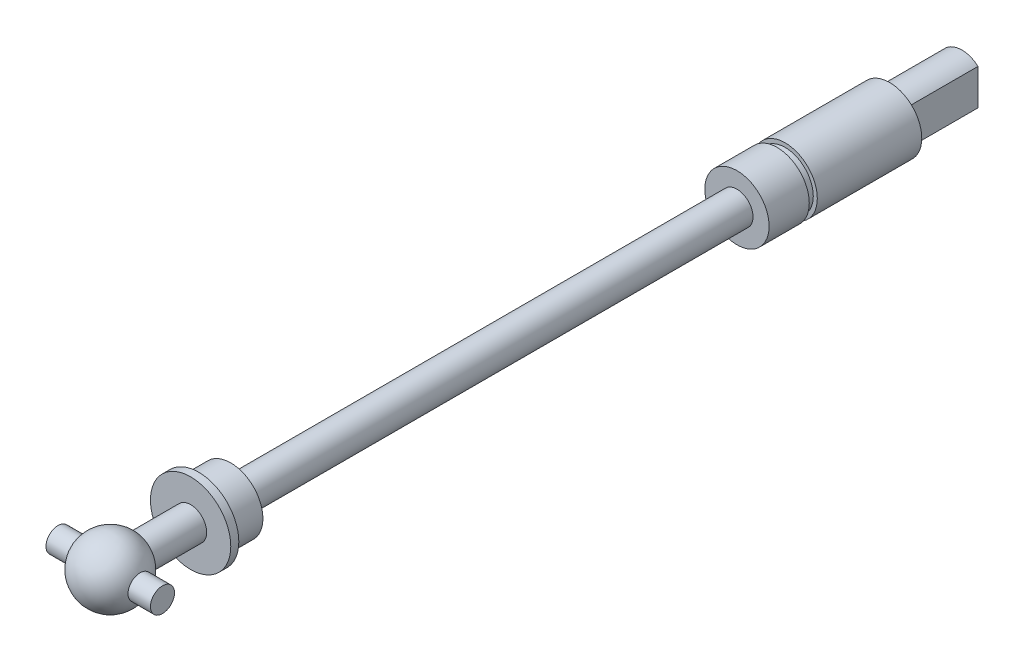
ISO-10303-21;
HEADER;
FILE_DESCRIPTION(('STEP AP214'),'2;1');
FILE_NAME('part.step','',(''),(''),'','','');
FILE_SCHEMA(('AUTOMOTIVE_DESIGN { 1 0 10303 214 1 1 1 1 }'));
ENDSEC;
DATA;
#1=APPLICATION_CONTEXT('core data for automotive mechanical design processes');
#2=APPLICATION_PROTOCOL_DEFINITION('international standard','automotive_design',2000,#1);
#3=PRODUCT_CONTEXT('',#1,'mechanical');
#4=PRODUCT('Part','Part','',(#3));
#5=PRODUCT_RELATED_PRODUCT_CATEGORY('part','',(#4));
#6=PRODUCT_DEFINITION_FORMATION('','',#4);
#7=PRODUCT_DEFINITION_CONTEXT('part definition',#1,'design');
#8=PRODUCT_DEFINITION('design','',#6,#7);
#9=PRODUCT_DEFINITION_SHAPE('','',#8);
#10=(LENGTH_UNIT() NAMED_UNIT(*) SI_UNIT(.MILLI.,.METRE.));
#11=(NAMED_UNIT(*) PLANE_ANGLE_UNIT() SI_UNIT($,.RADIAN.));
#12=(NAMED_UNIT(*) SI_UNIT($,.STERADIAN.) SOLID_ANGLE_UNIT());
#13=UNCERTAINTY_MEASURE_WITH_UNIT(LENGTH_MEASURE(1.E-05),#10,'distance_accuracy_value','');
#14=(GEOMETRIC_REPRESENTATION_CONTEXT(3) GLOBAL_UNCERTAINTY_ASSIGNED_CONTEXT((#13)) GLOBAL_UNIT_ASSIGNED_CONTEXT((#10,
#11,#12)) REPRESENTATION_CONTEXT('',''));
#15=CARTESIAN_POINT('',(0.,0.,0.));
#16=DIRECTION('',(0.,0.,1.));
#17=DIRECTION('',(1.,0.,0.));
#18=AXIS2_PLACEMENT_3D('',#15,#16,#17);
#19=CARTESIAN_POINT('',(0.,0.,-4.));
#20=DIRECTION('',(0.,0.,1.));
#21=DIRECTION('',(0.,1.,0.));
#22=AXIS2_PLACEMENT_3D('',#19,#20,#21);
#23=SPHERICAL_SURFACE('',#22,4.);
#24=CARTESIAN_POINT('',(0.,0.,-7.46410161513776));
#25=DIRECTION('',(0.,0.,1.));
#26=DIRECTION('',(1.,0.,0.));
#27=AXIS2_PLACEMENT_3D('',#24,#25,#26);
#28=CIRCLE('',#27,2.);
#29=CARTESIAN_POINT('',(2.,0.,-7.46410161513776));
#30=VERTEX_POINT('',#29);
#31=EDGE_CURVE('E141',#30,#30,#28,.T.);
#32=ORIENTED_EDGE('',*,*,#31,.T.);
#33=EDGE_LOOP('',(#32));
#34=FACE_BOUND('',#33,.T.);
#35=CARTESIAN_POINT('',(3.70809924354783,0.,-4.));
#36=DIRECTION('',(-1.,0.,0.));
#37=DIRECTION('',(0.,0.,1.));
#38=AXIS2_PLACEMENT_3D('',#35,#36,#37);
#39=CIRCLE('',#38,1.5);
#40=CARTESIAN_POINT('',(3.70809924354783,0.,-2.5));
#41=VERTEX_POINT('',#40);
#42=EDGE_CURVE('E41',#41,#41,#39,.F.);
#43=ORIENTED_EDGE('',*,*,#42,.F.);
#44=EDGE_LOOP('',(#43));
#45=FACE_BOUND('',#44,.T.);
#46=CARTESIAN_POINT('',(-3.70809924354783,0.,-4.));
#47=DIRECTION('',(1.,0.,0.));
#48=DIRECTION('',(0.,0.,-1.));
#49=AXIS2_PLACEMENT_3D('',#46,#47,#48);
#50=CIRCLE('',#49,1.5);
#51=CARTESIAN_POINT('',(-3.70809924354783,0.,-5.5));
#52=VERTEX_POINT('',#51);
#53=EDGE_CURVE('E11',#52,#52,#50,.F.);
#54=ORIENTED_EDGE('',*,*,#53,.F.);
#55=EDGE_LOOP('',(#54));
#56=FACE_BOUND('',#55,.T.);
#57=ADVANCED_FACE('F34',(#34,#45,#56),#23,.T.);
#58=CARTESIAN_POINT('',(0.,3.,-110.));
#59=DIRECTION('',(0.,0.,1.));
#60=DIRECTION('',(1.,0.,0.));
#61=AXIS2_PLACEMENT_3D('',#58,#59,#60);
#62=PLANE('',#61);
#63=CARTESIAN_POINT('',(0.,0.,-110.));
#64=DIRECTION('',(0.,0.,1.));
#65=DIRECTION('',(1.,0.,0.));
#66=AXIS2_PLACEMENT_3D('',#63,#64,#65);
#67=CIRCLE('',#66,3.);
#68=CARTESIAN_POINT('',(2.,2.23606797749979,-110.));
#69=VERTEX_POINT('',#68);
#70=CARTESIAN_POINT('',(-2.,2.23606797749979,-110.));
#71=VERTEX_POINT('',#70);
#72=EDGE_CURVE('E91',#69,#71,#67,.T.);
#73=ORIENTED_EDGE('',*,*,#72,.F.);
#74=DIRECTION('',(0.,1.,0.));
#75=VECTOR('',#74,1.);
#76=CARTESIAN_POINT('',(2.,0.,-110.));
#77=LINE('',#76,#75);
#78=CARTESIAN_POINT('',(2.,-2.23606797749979,-110.));
#79=VERTEX_POINT('',#78);
#80=EDGE_CURVE('E74',#79,#69,#77,.T.);
#81=ORIENTED_EDGE('',*,*,#80,.F.);
#82=CARTESIAN_POINT('',(-2.,-2.23606797749979,-110.));
#83=VERTEX_POINT('',#82);
#84=EDGE_CURVE('E96',#83,#79,#67,.T.);
#85=ORIENTED_EDGE('',*,*,#84,.F.);
#86=DIRECTION('',(0.,1.,0.));
#87=VECTOR('',#86,1.);
#88=CARTESIAN_POINT('',(-2.,0.,-110.));
#89=LINE('',#88,#87);
#90=EDGE_CURVE('E85',#83,#71,#89,.T.);
#91=ORIENTED_EDGE('',*,*,#90,.T.);
#92=EDGE_LOOP('',(#73,#81,#85,#91));
#93=FACE_BOUND('',#92,.T.);
#94=ADVANCED_FACE('F95',(#93),#62,.F.);
#95=CARTESIAN_POINT('',(0.,0.,0.));
#96=DIRECTION('',(0.,0.,1.));
#97=DIRECTION('',(1.,0.,0.));
#98=AXIS2_PLACEMENT_3D('',#95,#96,#97);
#99=CYLINDRICAL_SURFACE('',#98,3.);
#100=ORIENTED_EDGE('',*,*,#84,.T.);
#101=DIRECTION('',(0.,0.,-1.));
#102=VECTOR('',#101,1.);
#103=CARTESIAN_POINT('',(2.,-2.23606797749979,-96.4174243050442));
#104=LINE('',#103,#102);
#105=CARTESIAN_POINT('',(2.,-2.23606797749979,-101.));
#106=VERTEX_POINT('',#105);
#107=EDGE_CURVE('E80',#106,#79,#104,.T.);
#108=ORIENTED_EDGE('',*,*,#107,.F.);
#109=CARTESIAN_POINT('',(0.,0.,-101.));
#110=DIRECTION('',(0.,0.,1.));
#111=DIRECTION('',(1.,0.,0.));
#112=AXIS2_PLACEMENT_3D('',#109,#110,#111);
#113=CIRCLE('',#112,3.);
#114=CARTESIAN_POINT('',(-2.,-2.23606797749979,-101.));
#115=VERTEX_POINT('',#114);
#116=EDGE_CURVE('E101',#115,#106,#113,.T.);
#117=ORIENTED_EDGE('',*,*,#116,.F.);
#118=DIRECTION('',(0.,0.,-1.));
#119=VECTOR('',#118,1.);
#120=CARTESIAN_POINT('',(-2.,-2.23606797749979,-96.4174243050442));
#121=LINE('',#120,#119);
#122=EDGE_CURVE('E48',#115,#83,#121,.T.);
#123=ORIENTED_EDGE('',*,*,#122,.T.);
#124=EDGE_LOOP('',(#100,#108,#117,#123));
#125=FACE_BOUND('',#124,.T.);
#126=ADVANCED_FACE('F244',(#125),#99,.T.);
#127=CARTESIAN_POINT('',(2.,2.23606797749979,-101.));
#128=VERTEX_POINT('',#127);
#129=CARTESIAN_POINT('',(-2.,2.23606797749979,-101.));
#130=VERTEX_POINT('',#129);
#131=EDGE_CURVE('E92',#128,#130,#113,.T.);
#132=ORIENTED_EDGE('',*,*,#131,.F.);
#133=DIRECTION('',(0.,0.,-1.));
#134=VECTOR('',#133,1.);
#135=CARTESIAN_POINT('',(2.,2.23606797749979,-96.4174243050442));
#136=LINE('',#135,#134);
#137=EDGE_CURVE('E77',#128,#69,#136,.T.);
#138=ORIENTED_EDGE('',*,*,#137,.T.);
#139=ORIENTED_EDGE('',*,*,#72,.T.);
#140=DIRECTION('',(0.,0.,-1.));
#141=VECTOR('',#140,1.);
#142=CARTESIAN_POINT('',(-2.,2.23606797749979,-96.4174243050442));
#143=LINE('',#142,#141);
#144=EDGE_CURVE('E145',#130,#71,#143,.T.);
#145=ORIENTED_EDGE('',*,*,#144,.F.);
#146=EDGE_LOOP('',(#132,#138,#139,#145));
#147=FACE_BOUND('',#146,.T.);
#148=ADVANCED_FACE('F89',(#147),#99,.T.);
#149=CARTESIAN_POINT('',(0.,4.,-101.));
#150=DIRECTION('',(0.,0.,1.));
#151=DIRECTION('',(1.,0.,0.));
#152=AXIS2_PLACEMENT_3D('',#149,#150,#151);
#153=PLANE('',#152);
#154=CARTESIAN_POINT('',(0.,0.,-101.));
#155=DIRECTION('',(0.,0.,1.));
#156=DIRECTION('',(1.,0.,0.));
#157=AXIS2_PLACEMENT_3D('',#154,#155,#156);
#158=CIRCLE('',#157,4.);
#159=CARTESIAN_POINT('',(4.,0.,-101.));
#160=VERTEX_POINT('',#159);
#161=EDGE_CURVE('E102',#160,#160,#158,.T.);
#162=ORIENTED_EDGE('',*,*,#161,.F.);
#163=EDGE_LOOP('',(#162));
#164=FACE_BOUND('',#163,.T.);
#165=ORIENTED_EDGE('',*,*,#131,.T.);
#166=DIRECTION('',(0.,1.,0.));
#167=VECTOR('',#166,1.);
#168=CARTESIAN_POINT('',(-2.,0.,-101.));
#169=LINE('',#168,#167);
#170=EDGE_CURVE('E147',#115,#130,#169,.T.);
#171=ORIENTED_EDGE('',*,*,#170,.F.);
#172=ORIENTED_EDGE('',*,*,#116,.T.);
#173=DIRECTION('',(0.,1.,0.));
#174=VECTOR('',#173,1.);
#175=CARTESIAN_POINT('',(2.,0.,-101.));
#176=LINE('',#175,#174);
#177=EDGE_CURVE('E56',#106,#128,#176,.T.);
#178=ORIENTED_EDGE('',*,*,#177,.T.);
#179=EDGE_LOOP('',(#165,#171,#172,#178));
#180=FACE_BOUND('',#179,.T.);
#181=ADVANCED_FACE('F239',(#164,#180),#153,.F.);
#182=CARTESIAN_POINT('',(0.,0.,0.));
#183=DIRECTION('',(0.,0.,1.));
#184=DIRECTION('',(1.,0.,0.));
#185=AXIS2_PLACEMENT_3D('',#182,#183,#184);
#186=CYLINDRICAL_SURFACE('',#185,4.);
#187=CARTESIAN_POINT('',(0.,0.,-88.));
#188=DIRECTION('',(0.,0.,1.));
#189=DIRECTION('',(1.,0.,0.));
#190=AXIS2_PLACEMENT_3D('',#187,#188,#189);
#191=CIRCLE('',#190,4.);
#192=CARTESIAN_POINT('',(4.,0.,-88.));
#193=VERTEX_POINT('',#192);
#194=EDGE_CURVE('E105',#193,#193,#191,.T.);
#195=ORIENTED_EDGE('',*,*,#194,.F.);
#196=EDGE_LOOP('',(#195));
#197=FACE_BOUND('',#196,.T.);
#198=ORIENTED_EDGE('',*,*,#161,.T.);
#199=EDGE_LOOP('',(#198));
#200=FACE_BOUND('',#199,.T.);
#201=ADVANCED_FACE('F235',(#197,#200),#186,.T.);
#202=CARTESIAN_POINT('',(0.,3.5,-88.));
#203=DIRECTION('',(0.,0.,-1.));
#204=DIRECTION('',(-1.,0.,0.));
#205=AXIS2_PLACEMENT_3D('',#202,#203,#204);
#206=PLANE('',#205);
#207=CARTESIAN_POINT('',(0.,0.,-88.));
#208=DIRECTION('',(0.,0.,1.));
#209=DIRECTION('',(1.,0.,0.));
#210=AXIS2_PLACEMENT_3D('',#207,#208,#209);
#211=CIRCLE('',#210,3.5);
#212=CARTESIAN_POINT('',(3.5,0.,-88.));
#213=VERTEX_POINT('',#212);
#214=EDGE_CURVE('E108',#213,#213,#211,.T.);
#215=ORIENTED_EDGE('',*,*,#214,.F.);
#216=EDGE_LOOP('',(#215));
#217=FACE_BOUND('',#216,.T.);
#218=ORIENTED_EDGE('',*,*,#194,.T.);
#219=EDGE_LOOP('',(#218));
#220=FACE_BOUND('',#219,.T.);
#221=ADVANCED_FACE('F231',(#217,#220),#206,.F.);
#222=CARTESIAN_POINT('',(0.,0.,0.));
#223=DIRECTION('',(0.,0.,1.));
#224=DIRECTION('',(1.,0.,0.));
#225=AXIS2_PLACEMENT_3D('',#222,#223,#224);
#226=CYLINDRICAL_SURFACE('',#225,3.5);
#227=CARTESIAN_POINT('',(0.,0.,-87.));
#228=DIRECTION('',(0.,0.,1.));
#229=DIRECTION('',(1.,0.,0.));
#230=AXIS2_PLACEMENT_3D('',#227,#228,#229);
#231=CIRCLE('',#230,3.5);
#232=CARTESIAN_POINT('',(3.5,0.,-87.));
#233=VERTEX_POINT('',#232);
#234=EDGE_CURVE('E111',#233,#233,#231,.T.);
#235=ORIENTED_EDGE('',*,*,#234,.F.);
#236=EDGE_LOOP('',(#235));
#237=FACE_BOUND('',#236,.T.);
#238=ORIENTED_EDGE('',*,*,#214,.T.);
#239=EDGE_LOOP('',(#238));
#240=FACE_BOUND('',#239,.T.);
#241=ADVANCED_FACE('F227',(#237,#240),#226,.T.);
#242=CARTESIAN_POINT('',(0.,4.,-87.));
#243=DIRECTION('',(0.,0.,1.));
#244=DIRECTION('',(1.,0.,0.));
#245=AXIS2_PLACEMENT_3D('',#242,#243,#244);
#246=PLANE('',#245);
#247=CARTESIAN_POINT('',(0.,0.,-87.));
#248=DIRECTION('',(0.,0.,1.));
#249=DIRECTION('',(1.,0.,0.));
#250=AXIS2_PLACEMENT_3D('',#247,#248,#249);
#251=CIRCLE('',#250,4.);
#252=CARTESIAN_POINT('',(4.,0.,-87.));
#253=VERTEX_POINT('',#252);
#254=EDGE_CURVE('E114',#253,#253,#251,.T.);
#255=ORIENTED_EDGE('',*,*,#254,.F.);
#256=EDGE_LOOP('',(#255));
#257=FACE_BOUND('',#256,.T.);
#258=ORIENTED_EDGE('',*,*,#234,.T.);
#259=EDGE_LOOP('',(#258));
#260=FACE_BOUND('',#259,.T.);
#261=ADVANCED_FACE('F223',(#257,#260),#246,.F.);
#262=CARTESIAN_POINT('',(0.,0.,0.));
#263=DIRECTION('',(0.,0.,1.));
#264=DIRECTION('',(1.,0.,0.));
#265=AXIS2_PLACEMENT_3D('',#262,#263,#264);
#266=CYLINDRICAL_SURFACE('',#265,4.);
#267=CARTESIAN_POINT('',(0.,0.,-82.));
#268=DIRECTION('',(0.,0.,1.));
#269=DIRECTION('',(1.,0.,0.));
#270=AXIS2_PLACEMENT_3D('',#267,#268,#269);
#271=CIRCLE('',#270,4.);
#272=CARTESIAN_POINT('',(4.,0.,-82.));
#273=VERTEX_POINT('',#272);
#274=EDGE_CURVE('E117',#273,#273,#271,.T.);
#275=ORIENTED_EDGE('',*,*,#274,.F.);
#276=EDGE_LOOP('',(#275));
#277=FACE_BOUND('',#276,.T.);
#278=ORIENTED_EDGE('',*,*,#254,.T.);
#279=EDGE_LOOP('',(#278));
#280=FACE_BOUND('',#279,.T.);
#281=ADVANCED_FACE('F219',(#277,#280),#266,.T.);
#282=CARTESIAN_POINT('',(0.,2.,-82.));
#283=DIRECTION('',(0.,0.,-1.));
#284=DIRECTION('',(-1.,0.,0.));
#285=AXIS2_PLACEMENT_3D('',#282,#283,#284);
#286=PLANE('',#285);
#287=CARTESIAN_POINT('',(0.,0.,-82.));
#288=DIRECTION('',(0.,0.,1.));
#289=DIRECTION('',(1.,0.,0.));
#290=AXIS2_PLACEMENT_3D('',#287,#288,#289);
#291=CIRCLE('',#290,2.);
#292=CARTESIAN_POINT('',(2.,0.,-82.));
#293=VERTEX_POINT('',#292);
#294=EDGE_CURVE('E120',#293,#293,#291,.T.);
#295=ORIENTED_EDGE('',*,*,#294,.F.);
#296=EDGE_LOOP('',(#295));
#297=FACE_BOUND('',#296,.T.);
#298=ORIENTED_EDGE('',*,*,#274,.T.);
#299=EDGE_LOOP('',(#298));
#300=FACE_BOUND('',#299,.T.);
#301=ADVANCED_FACE('F215',(#297,#300),#286,.F.);
#302=CARTESIAN_POINT('',(0.,0.,0.));
#303=DIRECTION('',(0.,0.,1.));
#304=DIRECTION('',(1.,0.,0.));
#305=AXIS2_PLACEMENT_3D('',#302,#303,#304);
#306=CYLINDRICAL_SURFACE('',#305,2.);
#307=CARTESIAN_POINT('',(0.,0.,-19.));
#308=DIRECTION('',(0.,0.,1.));
#309=DIRECTION('',(1.,0.,0.));
#310=AXIS2_PLACEMENT_3D('',#307,#308,#309);
#311=CIRCLE('',#310,2.);
#312=CARTESIAN_POINT('',(2.,0.,-19.));
#313=VERTEX_POINT('',#312);
#314=EDGE_CURVE('E123',#313,#313,#311,.T.);
#315=ORIENTED_EDGE('',*,*,#314,.F.);
#316=EDGE_LOOP('',(#315));
#317=FACE_BOUND('',#316,.T.);
#318=ORIENTED_EDGE('',*,*,#294,.T.);
#319=EDGE_LOOP('',(#318));
#320=FACE_BOUND('',#319,.T.);
#321=ADVANCED_FACE('F211',(#317,#320),#306,.T.);
#322=CARTESIAN_POINT('',(0.,4.,-19.));
#323=DIRECTION('',(0.,0.,1.));
#324=DIRECTION('',(1.,0.,0.));
#325=AXIS2_PLACEMENT_3D('',#322,#323,#324);
#326=PLANE('',#325);
#327=CARTESIAN_POINT('',(0.,0.,-19.));
#328=DIRECTION('',(0.,0.,1.));
#329=DIRECTION('',(1.,0.,0.));
#330=AXIS2_PLACEMENT_3D('',#327,#328,#329);
#331=CIRCLE('',#330,4.);
#332=CARTESIAN_POINT('',(4.,0.,-19.));
#333=VERTEX_POINT('',#332);
#334=EDGE_CURVE('E126',#333,#333,#331,.T.);
#335=ORIENTED_EDGE('',*,*,#334,.F.);
#336=EDGE_LOOP('',(#335));
#337=FACE_BOUND('',#336,.T.);
#338=ORIENTED_EDGE('',*,*,#314,.T.);
#339=EDGE_LOOP('',(#338));
#340=FACE_BOUND('',#339,.T.);
#341=ADVANCED_FACE('F207',(#337,#340),#326,.F.);
#342=CARTESIAN_POINT('',(0.,0.,0.));
#343=DIRECTION('',(0.,0.,1.));
#344=DIRECTION('',(1.,0.,0.));
#345=AXIS2_PLACEMENT_3D('',#342,#343,#344);
#346=CYLINDRICAL_SURFACE('',#345,4.);
#347=CARTESIAN_POINT('',(0.,0.,-15.));
#348=DIRECTION('',(0.,0.,1.));
#349=DIRECTION('',(1.,0.,0.));
#350=AXIS2_PLACEMENT_3D('',#347,#348,#349);
#351=CIRCLE('',#350,4.);
#352=CARTESIAN_POINT('',(4.,0.,-15.));
#353=VERTEX_POINT('',#352);
#354=EDGE_CURVE('E129',#353,#353,#351,.T.);
#355=ORIENTED_EDGE('',*,*,#354,.F.);
#356=EDGE_LOOP('',(#355));
#357=FACE_BOUND('',#356,.T.);
#358=ORIENTED_EDGE('',*,*,#334,.T.);
#359=EDGE_LOOP('',(#358));
#360=FACE_BOUND('',#359,.T.);
#361=ADVANCED_FACE('F203',(#357,#360),#346,.T.);
#362=CARTESIAN_POINT('',(0.,5.,-15.));
#363=DIRECTION('',(0.,0.,1.));
#364=DIRECTION('',(1.,0.,0.));
#365=AXIS2_PLACEMENT_3D('',#362,#363,#364);
#366=PLANE('',#365);
#367=CARTESIAN_POINT('',(0.,0.,-15.));
#368=DIRECTION('',(0.,0.,1.));
#369=DIRECTION('',(1.,0.,0.));
#370=AXIS2_PLACEMENT_3D('',#367,#368,#369);
#371=CIRCLE('',#370,5.);
#372=CARTESIAN_POINT('',(5.,0.,-15.));
#373=VERTEX_POINT('',#372);
#374=EDGE_CURVE('E132',#373,#373,#371,.T.);
#375=ORIENTED_EDGE('',*,*,#374,.F.);
#376=EDGE_LOOP('',(#375));
#377=FACE_BOUND('',#376,.T.);
#378=ORIENTED_EDGE('',*,*,#354,.T.);
#379=EDGE_LOOP('',(#378));
#380=FACE_BOUND('',#379,.T.);
#381=ADVANCED_FACE('F199',(#377,#380),#366,.F.);
#382=CARTESIAN_POINT('',(0.,0.,0.));
#383=DIRECTION('',(0.,0.,1.));
#384=DIRECTION('',(1.,0.,0.));
#385=AXIS2_PLACEMENT_3D('',#382,#383,#384);
#386=CYLINDRICAL_SURFACE('',#385,5.);
#387=CARTESIAN_POINT('',(0.,0.,-14.));
#388=DIRECTION('',(0.,0.,1.));
#389=DIRECTION('',(1.,0.,0.));
#390=AXIS2_PLACEMENT_3D('',#387,#388,#389);
#391=CIRCLE('',#390,5.);
#392=CARTESIAN_POINT('',(5.,0.,-14.));
#393=VERTEX_POINT('',#392);
#394=EDGE_CURVE('E135',#393,#393,#391,.T.);
#395=ORIENTED_EDGE('',*,*,#394,.F.);
#396=EDGE_LOOP('',(#395));
#397=FACE_BOUND('',#396,.T.);
#398=ORIENTED_EDGE('',*,*,#374,.T.);
#399=EDGE_LOOP('',(#398));
#400=FACE_BOUND('',#399,.T.);
#401=ADVANCED_FACE('F195',(#397,#400),#386,.T.);
#402=CARTESIAN_POINT('',(0.,2.,-14.));
#403=DIRECTION('',(0.,0.,-1.));
#404=DIRECTION('',(-1.,0.,0.));
#405=AXIS2_PLACEMENT_3D('',#402,#403,#404);
#406=PLANE('',#405);
#407=CARTESIAN_POINT('',(0.,0.,-14.));
#408=DIRECTION('',(0.,0.,1.));
#409=DIRECTION('',(1.,0.,0.));
#410=AXIS2_PLACEMENT_3D('',#407,#408,#409);
#411=CIRCLE('',#410,2.);
#412=CARTESIAN_POINT('',(2.,0.,-14.));
#413=VERTEX_POINT('',#412);
#414=EDGE_CURVE('E138',#413,#413,#411,.T.);
#415=ORIENTED_EDGE('',*,*,#414,.F.);
#416=EDGE_LOOP('',(#415));
#417=FACE_BOUND('',#416,.T.);
#418=ORIENTED_EDGE('',*,*,#394,.T.);
#419=EDGE_LOOP('',(#418));
#420=FACE_BOUND('',#419,.T.);
#421=ADVANCED_FACE('F191',(#417,#420),#406,.F.);
#422=CARTESIAN_POINT('',(0.,0.,0.));
#423=DIRECTION('',(0.,0.,1.));
#424=DIRECTION('',(1.,0.,0.));
#425=AXIS2_PLACEMENT_3D('',#422,#423,#424);
#426=CYLINDRICAL_SURFACE('',#425,2.);
#427=ORIENTED_EDGE('',*,*,#31,.F.);
#428=EDGE_LOOP('',(#427));
#429=FACE_BOUND('',#428,.T.);
#430=ORIENTED_EDGE('',*,*,#414,.T.);
#431=EDGE_LOOP('',(#430));
#432=FACE_BOUND('',#431,.T.);
#433=ADVANCED_FACE('F188',(#429,#432),#426,.T.);
#434=CARTESIAN_POINT('',(-2.,0.,-96.4174243050442));
#435=DIRECTION('',(-1.,0.,0.));
#436=DIRECTION('',(0.,-1.,0.));
#437=AXIS2_PLACEMENT_3D('',#434,#435,#436);
#438=PLANE('',#437);
#439=ORIENTED_EDGE('',*,*,#170,.T.);
#440=ORIENTED_EDGE('',*,*,#144,.T.);
#441=ORIENTED_EDGE('',*,*,#90,.F.);
#442=ORIENTED_EDGE('',*,*,#122,.F.);
#443=EDGE_LOOP('',(#439,#440,#441,#442));
#444=FACE_BOUND('',#443,.T.);
#445=ADVANCED_FACE('F185',(#444),#438,.T.);
#446=CARTESIAN_POINT('',(2.,0.,-96.4174243050442));
#447=DIRECTION('',(-1.,0.,0.));
#448=DIRECTION('',(0.,-1.,0.));
#449=AXIS2_PLACEMENT_3D('',#446,#447,#448);
#450=PLANE('',#449);
#451=ORIENTED_EDGE('',*,*,#107,.T.);
#452=ORIENTED_EDGE('',*,*,#80,.T.);
#453=ORIENTED_EDGE('',*,*,#137,.F.);
#454=ORIENTED_EDGE('',*,*,#177,.F.);
#455=EDGE_LOOP('',(#451,#452,#453,#454));
#456=FACE_BOUND('',#455,.T.);
#457=ADVANCED_FACE('F76',(#456),#450,.F.);
#458=CARTESIAN_POINT('',(6.5,0.,0.));
#459=DIRECTION('',(1.,0.,0.));
#460=DIRECTION('',(0.,0.,-1.));
#461=AXIS2_PLACEMENT_3D('',#458,#459,#460);
#462=PLANE('',#461);
#463=CARTESIAN_POINT('',(6.5,0.,-4.));
#464=DIRECTION('',(1.,0.,0.));
#465=DIRECTION('',(0.,0.,-1.));
#466=AXIS2_PLACEMENT_3D('',#463,#464,#465);
#467=CIRCLE('',#466,1.5);
#468=CARTESIAN_POINT('',(6.5,0.,-5.5));
#469=VERTEX_POINT('',#468);
#470=EDGE_CURVE('E149',#469,#469,#467,.T.);
#471=ORIENTED_EDGE('',*,*,#470,.T.);
#472=EDGE_LOOP('',(#471));
#473=FACE_BOUND('',#472,.T.);
#474=ADVANCED_FACE('F159',(#473),#462,.T.);
#475=CARTESIAN_POINT('',(6.5,0.,-4.));
#476=DIRECTION('',(-1.,0.,0.));
#477=DIRECTION('',(0.,0.,1.));
#478=AXIS2_PLACEMENT_3D('',#475,#476,#477);
#479=CYLINDRICAL_SURFACE('',#478,1.5);
#480=ORIENTED_EDGE('',*,*,#470,.F.);
#481=EDGE_LOOP('',(#480));
#482=FACE_BOUND('',#481,.T.);
#483=ORIENTED_EDGE('',*,*,#42,.T.);
#484=EDGE_LOOP('',(#483));
#485=FACE_BOUND('',#484,.T.);
#486=ADVANCED_FACE('F161',(#482,#485),#479,.T.);
#487=CARTESIAN_POINT('',(-6.5,0.,-4.));
#488=DIRECTION('',(1.,0.,0.));
#489=DIRECTION('',(0.,0.,-1.));
#490=AXIS2_PLACEMENT_3D('',#487,#488,#489);
#491=CIRCLE('',#490,1.5);
#492=CARTESIAN_POINT('',(-6.5,0.,-5.5));
#493=VERTEX_POINT('',#492);
#494=EDGE_CURVE('E153',#493,#493,#491,.T.);
#495=ORIENTED_EDGE('',*,*,#494,.T.);
#496=EDGE_LOOP('',(#495));
#497=FACE_BOUND('',#496,.T.);
#498=ORIENTED_EDGE('',*,*,#53,.T.);
#499=EDGE_LOOP('',(#498));
#500=FACE_BOUND('',#499,.T.);
#501=ADVANCED_FACE('F164',(#497,#500),#479,.T.);
#502=CARTESIAN_POINT('',(-6.5,0.,0.));
#503=DIRECTION('',(1.,0.,0.));
#504=DIRECTION('',(0.,0.,-1.));
#505=AXIS2_PLACEMENT_3D('',#502,#503,#504);
#506=PLANE('',#505);
#507=ORIENTED_EDGE('',*,*,#494,.F.);
#508=EDGE_LOOP('',(#507));
#509=FACE_BOUND('',#508,.T.);
#510=ADVANCED_FACE('F174',(#509),#506,.F.);
#511=CLOSED_SHELL('',(#57,#94,#126,#148,#181,#201,#221,#241,#261,#281,#301,#321,#341,#361,#381,
#401,#421,#433,#445,#457,#474,#486,#501,#510));
#512=MANIFOLD_SOLID_BREP('B2',#511);
#513=ADVANCED_BREP_SHAPE_REPRESENTATION('',(#18,#512),#14);
#514=SHAPE_DEFINITION_REPRESENTATION(#9,#513);
ENDSEC;
END-ISO-10303-21;
